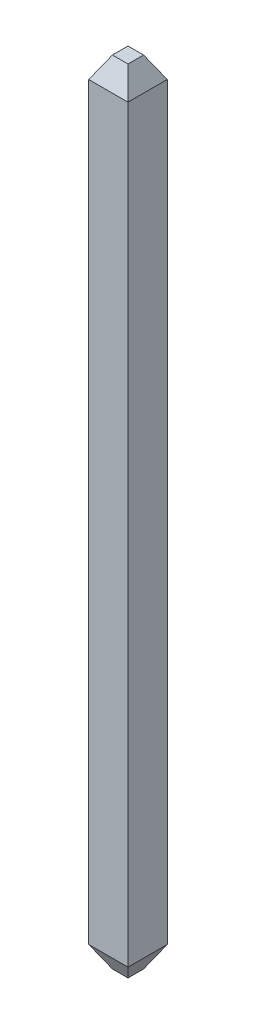
ISO-10303-21;
HEADER;
FILE_DESCRIPTION(('STEP AP214'),'2;1');
FILE_NAME('part.step','',(''),(''),'','','');
FILE_SCHEMA(('AUTOMOTIVE_DESIGN { 1 0 10303 214 1 1 1 1 }'));
ENDSEC;
DATA;
#1=APPLICATION_CONTEXT('core data for automotive mechanical design processes');
#2=APPLICATION_PROTOCOL_DEFINITION('international standard','automotive_design',2000,#1);
#3=PRODUCT_CONTEXT('',#1,'mechanical');
#4=PRODUCT('Part','Part','',(#3));
#5=PRODUCT_RELATED_PRODUCT_CATEGORY('part','',(#4));
#6=PRODUCT_DEFINITION_FORMATION('','',#4);
#7=PRODUCT_DEFINITION_CONTEXT('part definition',#1,'design');
#8=PRODUCT_DEFINITION('design','',#6,#7);
#9=PRODUCT_DEFINITION_SHAPE('','',#8);
#10=(LENGTH_UNIT() NAMED_UNIT(*) SI_UNIT(.MILLI.,.METRE.));
#11=(NAMED_UNIT(*) PLANE_ANGLE_UNIT() SI_UNIT($,.RADIAN.));
#12=(NAMED_UNIT(*) SI_UNIT($,.STERADIAN.) SOLID_ANGLE_UNIT());
#13=UNCERTAINTY_MEASURE_WITH_UNIT(LENGTH_MEASURE(1.E-05),#10,'distance_accuracy_value','');
#14=(GEOMETRIC_REPRESENTATION_CONTEXT(3) GLOBAL_UNCERTAINTY_ASSIGNED_CONTEXT((#13)) GLOBAL_UNIT_ASSIGNED_CONTEXT((#10,
#11,#12)) REPRESENTATION_CONTEXT('',''));
#15=CARTESIAN_POINT('',(0.,0.,0.));
#16=DIRECTION('',(0.,0.,1.));
#17=DIRECTION('',(1.,0.,0.));
#18=AXIS2_PLACEMENT_3D('',#15,#16,#17);
#19=CARTESIAN_POINT('',(0.497289871213,-21.22226807941,-2.830960592368));
#20=DIRECTION('',(0.,0.488489958076213,0.87256951634738));
#21=DIRECTION('',(0.,-0.87256951634738,0.488489958076213));
#22=AXIS2_PLACEMENT_3D('',#19,#20,#21);
#23=PLANE('',#22);
#24=DIRECTION('',(1.,0.,0.));
#25=VECTOR('',#24,1.);
#26=CARTESIAN_POINT('',(0.497289871213,-21.57099360271,-2.63573383614207));
#27=LINE('',#26,#25);
#28=CARTESIAN_POINT('',(0.48728989589798,-21.5709939289416,-2.63573383615462));
#29=VERTEX_POINT('',#28);
#30=CARTESIAN_POINT('',(-0.142710289145667,-21.5709938896675,-2.63573367549548));
#31=VERTEX_POINT('',#30);
#32=EDGE_CURVE('E118',#29,#31,#27,.F.);
#33=ORIENTED_EDGE('',*,*,#32,.F.);
#34=DIRECTION('',(0.438284036988266,-0.784297353956642,0.439072617567844));
#35=VECTOR('',#34,1.);
#36=CARTESIAN_POINT('',(0.29728987121219,-21.2309937745705,-2.826075692787));
#37=LINE('',#36,#35);
#38=CARTESIAN_POINT('',(0.297289871212797,-21.2309937745703,-2.82607569278742));
#39=VERTEX_POINT('',#38);
#40=EDGE_CURVE('E116',#39,#29,#37,.T.);
#41=ORIENTED_EDGE('',*,*,#40,.F.);
#42=DIRECTION('',(-1.,0.,0.));
#43=VECTOR('',#42,1.);
#44=CARTESIAN_POINT('',(0.307289871213,-21.23099377457,-2.826075692787));
#45=LINE('',#44,#43);
#46=CARTESIAN_POINT('',(0.0472898712130213,-21.2309937745702,-2.82607569278742));
#47=VERTEX_POINT('',#46);
#48=EDGE_CURVE('E79',#47,#39,#45,.F.);
#49=ORIENTED_EDGE('',*,*,#48,.F.);
#50=DIRECTION('',(0.438284036988271,0.784297353956651,-0.439072617567822));
#51=VECTOR('',#50,1.);
#52=CARTESIAN_POINT('',(-0.14271012878781,-21.5709936027095,-2.635733836142));
#53=LINE('',#52,#51);
#54=EDGE_CURVE('E110',#31,#47,#53,.T.);
#55=ORIENTED_EDGE('',*,*,#54,.F.);
#56=EDGE_LOOP('',(#33,#41,#49,#55));
#57=FACE_BOUND('',#56,.T.);
#58=ADVANCED_FACE('F17',(#57),#23,.T.);
#59=CARTESIAN_POINT('',(0.497289871213,-33.93541112064,-2.830708664644));
#60=DIRECTION('',(0.,-0.487152273933216,0.873317045523387));
#61=DIRECTION('',(0.,-0.873317045523387,-0.487152273933216));
#62=AXIS2_PLACEMENT_3D('',#59,#60,#61);
#63=PLANE('',#62);
#64=DIRECTION('',(-0.438586917260296,-0.784839349958941,-0.437799852403055));
#65=VECTOR('',#64,1.);
#66=CARTESIAN_POINT('',(0.487290184384019,-33.5866775616409,-2.636177793235));
#67=LINE('',#66,#65);
#68=CARTESIAN_POINT('',(0.487289980136551,-33.5866774630266,-2.63617803823828));
#69=VERTEX_POINT('',#68);
#70=CARTESIAN_POINT('',(0.29728987121302,-33.9266779501895,-2.82583714190599));
#71=VERTEX_POINT('',#70);
#72=EDGE_CURVE('E122',#69,#71,#67,.T.);
#73=ORIENTED_EDGE('',*,*,#72,.F.);
#74=DIRECTION('',(1.,0.,0.));
#75=VECTOR('',#74,1.);
#76=CARTESIAN_POINT('',(0.497289871213,-33.5866774970136,-2.63617715378033));
#77=LINE('',#76,#75);
#78=CARTESIAN_POINT('',(-0.142710305819021,-33.5866774872793,-2.63617803998363));
#79=VERTEX_POINT('',#78);
#80=EDGE_CURVE('E89',#79,#69,#77,.T.);
#81=ORIENTED_EDGE('',*,*,#80,.F.);
#82=DIRECTION('',(-0.438586917260197,0.784839349958759,0.43779985240348));
#83=VECTOR('',#82,1.);
#84=CARTESIAN_POINT('',(0.0472898712136261,-33.9266779501897,-2.825837141905));
#85=LINE('',#84,#83);
#86=CARTESIAN_POINT('',(0.0472898712132013,-33.9266779501894,-2.82583714190599));
#87=VERTEX_POINT('',#86);
#88=EDGE_CURVE('E84',#87,#79,#85,.T.);
#89=ORIENTED_EDGE('',*,*,#88,.F.);
#90=DIRECTION('',(1.,0.,0.));
#91=VECTOR('',#90,1.);
#92=CARTESIAN_POINT('',(0.03728987121306,-33.92667795019,-2.825837141905));
#93=LINE('',#92,#91);
#94=EDGE_CURVE('E20',#71,#87,#93,.F.);
#95=ORIENTED_EDGE('',*,*,#94,.F.);
#96=EDGE_LOOP('',(#73,#81,#89,#95));
#97=FACE_BOUND('',#96,.T.);
#98=ADVANCED_FACE('F86',(#97),#63,.T.);
#99=CARTESIAN_POINT('',(0.03728987121306,-33.92667795019,-3.085837141905));
#100=DIRECTION('',(0.,-1.,0.));
#101=DIRECTION('',(1.,0.,0.));
#102=AXIS2_PLACEMENT_3D('',#99,#100,#101);
#103=PLANE('',#102);
#104=DIRECTION('',(0.,0.,1.));
#105=VECTOR('',#104,1.);
#106=CARTESIAN_POINT('',(0.0472898712136262,-33.9266779501897,-3.276178998549));
#107=LINE('',#106,#105);
#108=CARTESIAN_POINT('',(0.0472898712133431,-33.9266779501896,-3.07583714190458));
#109=VERTEX_POINT('',#108);
#110=EDGE_CURVE('E93',#109,#87,#107,.T.);
#111=ORIENTED_EDGE('',*,*,#110,.F.);
#112=DIRECTION('',(1.,0.,0.));
#113=VECTOR('',#112,1.);
#114=CARTESIAN_POINT('',(0.497289871213,-33.9266779501891,-3.07583714190334));
#115=LINE('',#114,#113);
#116=CARTESIAN_POINT('',(0.29728987121304,-33.9266779501898,-3.07583714190458));
#117=VERTEX_POINT('',#116);
#118=EDGE_CURVE('E129',#117,#109,#115,.F.);
#119=ORIENTED_EDGE('',*,*,#118,.F.);
#120=DIRECTION('',(0.,0.,1.));
#121=VECTOR('',#120,1.);
#122=CARTESIAN_POINT('',(0.297289871213079,-33.92667795019,-3.276178998549));
#123=LINE('',#122,#121);
#124=EDGE_CURVE('E98',#71,#117,#123,.F.);
#125=ORIENTED_EDGE('',*,*,#124,.F.);
#126=ORIENTED_EDGE('',*,*,#94,.T.);
#127=EDGE_LOOP('',(#111,#119,#125,#126));
#128=FACE_BOUND('',#127,.T.);
#129=ADVANCED_FACE('F95',(#128),#103,.T.);
#130=CARTESIAN_POINT('',(0.05216808666874,-33.93540738396,-3.276178998549));
#131=DIRECTION('',(-0.872943377132686,-0.487821545567825,0.));
#132=DIRECTION('',(0.487821545567825,-0.872943377132686,0.));
#133=AXIS2_PLACEMENT_3D('',#130,#131,#132);
#134=PLANE('',#133);
#135=DIRECTION('',(-0.43828470044216,0.784297071672233,-0.439072459537929));
#136=VECTOR('',#135,1.);
#137=CARTESIAN_POINT('',(0.04728987121306,-33.9266779501891,-3.07583714190334));
#138=LINE('',#137,#136);
#139=CARTESIAN_POINT('',(-0.142710211258918,-33.5866782459584,-3.26617818908374));
#140=VERTEX_POINT('',#139);
#141=EDGE_CURVE('E102',#109,#140,#138,.T.);
#142=ORIENTED_EDGE('',*,*,#141,.F.);
#143=ORIENTED_EDGE('',*,*,#110,.T.);
#144=ORIENTED_EDGE('',*,*,#88,.T.);
#145=DIRECTION('',(0.,0.,1.));
#146=VECTOR('',#145,1.);
#147=CARTESIAN_POINT('',(-0.142710128787,-33.58667874778,-2.951009103414));
#148=LINE('',#147,#146);
#149=EDGE_CURVE('E131',#140,#79,#148,.T.);
#150=ORIENTED_EDGE('',*,*,#149,.F.);
#151=EDGE_LOOP('',(#142,#143,#144,#150));
#152=FACE_BOUND('',#151,.T.);
#153=ADVANCED_FACE('F100',(#152),#134,.T.);
#154=CARTESIAN_POINT('',(0.307289871213,-21.23099377457,-3.086075692787));
#155=DIRECTION('',(0.,1.,0.));
#156=DIRECTION('',(-1.,0.,0.));
#157=AXIS2_PLACEMENT_3D('',#154,#155,#156);
#158=PLANE('',#157);
#159=ORIENTED_EDGE('',*,*,#48,.T.);
#160=DIRECTION('',(0.,0.,1.));
#161=VECTOR('',#160,1.);
#162=CARTESIAN_POINT('',(0.29728987121219,-21.2309937745705,-3.275733836142));
#163=LINE('',#162,#161);
#164=CARTESIAN_POINT('',(0.297289871212797,-21.2309937745704,-3.07607569278651));
#165=VERTEX_POINT('',#164);
#166=EDGE_CURVE('E113',#165,#39,#163,.T.);
#167=ORIENTED_EDGE('',*,*,#166,.F.);
#168=DIRECTION('',(1.,0.,0.));
#169=VECTOR('',#168,1.);
#170=CARTESIAN_POINT('',(0.497289871213,-21.2309937745711,-3.07607569278503));
#171=LINE('',#170,#169);
#172=CARTESIAN_POINT('',(0.0472898712130212,-21.2309937745703,-3.07607569278651));
#173=VERTEX_POINT('',#172);
#174=EDGE_CURVE('E140',#173,#165,#171,.T.);
#175=ORIENTED_EDGE('',*,*,#174,.F.);
#176=DIRECTION('',(0.,0.,1.));
#177=VECTOR('',#176,1.);
#178=CARTESIAN_POINT('',(0.047289871212935,-21.2309937745699,-3.275733836142));
#179=LINE('',#178,#177);
#180=EDGE_CURVE('E105',#47,#173,#179,.F.);
#181=ORIENTED_EDGE('',*,*,#180,.F.);
#182=EDGE_LOOP('',(#159,#167,#175,#181));
#183=FACE_BOUND('',#182,.T.);
#184=ADVANCED_FACE('F184',(#183),#158,.T.);
#185=CARTESIAN_POINT('',(-0.147588344243,-21.57972303648,-3.275733836142));
#186=DIRECTION('',(-0.872943377132686,0.487821545567825,0.));
#187=DIRECTION('',(-0.487821545567825,-0.872943377132686,0.));
#188=AXIS2_PLACEMENT_3D('',#185,#186,#187);
#189=PLANE('',#188);
#190=DIRECTION('',(0.,0.,1.));
#191=VECTOR('',#190,1.);
#192=CARTESIAN_POINT('',(-0.142710128787008,-21.57099360271,-2.951009103414));
#193=LINE('',#192,#191);
#194=CARTESIAN_POINT('',(-0.142710835596165,-21.5709953440113,-3.26573424510074));
#195=VERTEX_POINT('',#194);
#196=EDGE_CURVE('E137',#31,#195,#193,.F.);
#197=ORIENTED_EDGE('',*,*,#196,.F.);
#198=ORIENTED_EDGE('',*,*,#54,.T.);
#199=ORIENTED_EDGE('',*,*,#180,.T.);
#200=DIRECTION('',(0.43858642909022,0.784840434712895,0.437798396819316));
#201=VECTOR('',#200,1.);
#202=CARTESIAN_POINT('',(-0.142710849418,-21.5709957406264,-3.26573502870961));
#203=LINE('',#202,#201);
#204=EDGE_CURVE('E145',#195,#173,#203,.T.);
#205=ORIENTED_EDGE('',*,*,#204,.F.);
#206=EDGE_LOOP('',(#197,#198,#199,#205));
#207=FACE_BOUND('',#206,.T.);
#208=ADVANCED_FACE('F182',(#207),#189,.T.);
#209=CARTESIAN_POINT('',(0.292411655757,-21.2222643408,-3.275733836142));
#210=DIRECTION('',(0.872943377132686,0.487821545567825,0.));
#211=DIRECTION('',(-0.487821545567825,0.872943377132686,0.));
#212=AXIS2_PLACEMENT_3D('',#209,#210,#211);
#213=PLANE('',#212);
#214=ORIENTED_EDGE('',*,*,#166,.T.);
#215=ORIENTED_EDGE('',*,*,#40,.T.);
#216=DIRECTION('',(0.,0.,1.));
#217=VECTOR('',#216,1.);
#218=CARTESIAN_POINT('',(0.487289871212996,-21.57099621256,-3.276127345931));
#219=LINE('',#218,#217);
#220=CARTESIAN_POINT('',(0.487290141449586,-21.5709947896532,-3.26573371060214));
#221=VERTEX_POINT('',#220);
#222=EDGE_CURVE('E35',#221,#29,#219,.T.);
#223=ORIENTED_EDGE('',*,*,#222,.F.);
#224=DIRECTION('',(0.438586429090131,-0.784840434712933,-0.437798396819337));
#225=VECTOR('',#224,1.);
#226=CARTESIAN_POINT('',(0.297289871213,-21.2309937745711,-3.07607569278503));
#227=LINE('',#226,#225);
#228=EDGE_CURVE('E143',#165,#221,#227,.T.);
#229=ORIENTED_EDGE('',*,*,#228,.F.);
#230=EDGE_LOOP('',(#214,#215,#223,#229));
#231=FACE_BOUND('',#230,.T.);
#232=ADVANCED_FACE('F185',(#231),#213,.T.);
#233=CARTESIAN_POINT('',(0.497289871213,-21.45033675752,-2.635729384518));
#234=DIRECTION('',(0.,-3.68949151673341E-05,0.999999999319383));
#235=DIRECTION('',(0.,-0.999999999319383,-3.68949151673341E-05));
#236=AXIS2_PLACEMENT_3D('',#233,#234,#235);
#237=PLANE('',#236);
#238=DIRECTION('',(0.,0.999999999317418,3.69481335064018E-05));
#239=VECTOR('',#238,1.);
#240=CARTESIAN_POINT('',(-0.142710128787,-33.58667749699,-2.636177793235));
#241=LINE('',#240,#239);
#242=EDGE_CURVE('E134',#79,#31,#241,.T.);
#243=ORIENTED_EDGE('',*,*,#242,.F.);
#244=ORIENTED_EDGE('',*,*,#80,.T.);
#245=DIRECTION('',(0.,-0.999999999317418,-3.69481335064018E-05));
#246=VECTOR('',#245,1.);
#247=CARTESIAN_POINT('',(0.487289871212996,-21.57099360271,-2.635733836142));
#248=LINE('',#247,#246);
#249=EDGE_CURVE('E149',#29,#69,#248,.T.);
#250=ORIENTED_EDGE('',*,*,#249,.F.);
#251=ORIENTED_EDGE('',*,*,#32,.T.);
#252=EDGE_LOOP('',(#243,#244,#250,#251));
#253=FACE_BOUND('',#252,.T.);
#254=ADVANCED_FACE('F187',(#253),#237,.T.);
#255=CARTESIAN_POINT('',(0.492168086669,-33.57794868828,-3.276178998549));
#256=DIRECTION('',(0.872943377132686,-0.487821545567825,0.));
#257=DIRECTION('',(0.487821545567825,0.872943377132686,0.));
#258=AXIS2_PLACEMENT_3D('',#255,#256,#257);
#259=PLANE('',#258);
#260=ORIENTED_EDGE('',*,*,#124,.T.);
#261=DIRECTION('',(-0.438284700442048,-0.78429707167228,0.439072459537956));
#262=VECTOR('',#261,1.);
#263=CARTESIAN_POINT('',(0.487289673578,-33.5866791127601,-3.26617844392001));
#264=LINE('',#263,#262);
#265=CARTESIAN_POINT('',(0.487289755137329,-33.5866786503075,-3.26617787518449));
#266=VERTEX_POINT('',#265);
#267=EDGE_CURVE('E126',#266,#117,#264,.T.);
#268=ORIENTED_EDGE('',*,*,#267,.F.);
#269=DIRECTION('',(0.,0.,1.));
#270=VECTOR('',#269,1.);
#271=CARTESIAN_POINT('',(0.487289871213004,-33.58667749699,-3.276127345931));
#272=LINE('',#271,#270);
#273=EDGE_CURVE('E152',#69,#266,#272,.F.);
#274=ORIENTED_EDGE('',*,*,#273,.F.);
#275=ORIENTED_EDGE('',*,*,#72,.T.);
#276=EDGE_LOOP('',(#260,#268,#274,#275));
#277=FACE_BOUND('',#276,.T.);
#278=ADVANCED_FACE('F174',(#277),#259,.T.);
#279=CARTESIAN_POINT('',(0.497289871213,-33.93540364535,-3.070952242324));
#280=DIRECTION('',(0.,-0.488489958076213,-0.87256951634738));
#281=DIRECTION('',(0.,0.87256951634738,-0.488489958076213));
#282=AXIS2_PLACEMENT_3D('',#279,#280,#281);
#283=PLANE('',#282);
#284=ORIENTED_EDGE('',*,*,#267,.T.);
#285=ORIENTED_EDGE('',*,*,#118,.T.);
#286=ORIENTED_EDGE('',*,*,#141,.T.);
#287=DIRECTION('',(1.,0.,0.));
#288=VECTOR('',#287,1.);
#289=CARTESIAN_POINT('',(0.497289871213,-33.5866787478035,-3.26617715382711));
#290=LINE('',#289,#288);
#291=EDGE_CURVE('E155',#266,#140,#290,.F.);
#292=ORIENTED_EDGE('',*,*,#291,.F.);
#293=EDGE_LOOP('',(#284,#285,#286,#292));
#294=FACE_BOUND('',#293,.T.);
#295=ADVANCED_FACE('F177',(#294),#283,.T.);
#296=CARTESIAN_POINT('',(-0.142710128787,-33.75733847732,-2.951009103414));
#297=DIRECTION('',(-1.,0.,0.));
#298=DIRECTION('',(0.,-1.,0.));
#299=AXIS2_PLACEMENT_3D('',#296,#297,#298);
#300=PLANE('',#299);
#301=ORIENTED_EDGE('',*,*,#196,.T.);
#302=DIRECTION('',(0.,0.999999999319383,3.68949151676141E-05));
#303=VECTOR('',#302,1.);
#304=CARTESIAN_POINT('',(-0.142709931152,-33.75734199129,-3.266183450433));
#305=LINE('',#304,#303);
#306=EDGE_CURVE('E158',#140,#195,#305,.T.);
#307=ORIENTED_EDGE('',*,*,#306,.F.);
#308=ORIENTED_EDGE('',*,*,#149,.T.);
#309=ORIENTED_EDGE('',*,*,#242,.T.);
#310=EDGE_LOOP('',(#301,#307,#308,#309));
#311=FACE_BOUND('',#310,.T.);
#312=ADVANCED_FACE('F179',(#311),#300,.T.);
#313=CARTESIAN_POINT('',(0.497289871213,-21.22226060412,-3.071204170048));
#314=DIRECTION('',(0.,0.487152273933216,-0.873317045523387));
#315=DIRECTION('',(0.,0.873317045523387,0.487152273933216));
#316=AXIS2_PLACEMENT_3D('',#313,#314,#315);
#317=PLANE('',#316);
#318=DIRECTION('',(1.,0.,0.));
#319=VECTOR('',#318,1.);
#320=CARTESIAN_POINT('',(0.497289871213,-21.5709962125728,-3.26573383623899));
#321=LINE('',#320,#319);
#322=EDGE_CURVE('E26',#195,#221,#321,.T.);
#323=ORIENTED_EDGE('',*,*,#322,.F.);
#324=ORIENTED_EDGE('',*,*,#204,.T.);
#325=ORIENTED_EDGE('',*,*,#174,.T.);
#326=ORIENTED_EDGE('',*,*,#228,.T.);
#327=EDGE_LOOP('',(#323,#324,#325,#326));
#328=FACE_BOUND('',#327,.T.);
#329=ADVANCED_FACE('F168',(#328),#317,.T.);
#330=CARTESIAN_POINT('',(0.487289871213,-27.60384299983,-3.276127345931));
#331=DIRECTION('',(1.,0.,0.));
#332=DIRECTION('',(0.,1.,0.));
#333=AXIS2_PLACEMENT_3D('',#330,#331,#332);
#334=PLANE('',#333);
#335=ORIENTED_EDGE('',*,*,#249,.T.);
#336=ORIENTED_EDGE('',*,*,#273,.T.);
#337=DIRECTION('',(0.,0.999999999319383,3.68949151676141E-05));
#338=VECTOR('',#337,1.);
#339=CARTESIAN_POINT('',(0.487290591844,-33.75734199129,-3.266183450433));
#340=LINE('',#339,#338);
#341=EDGE_CURVE('E11',#221,#266,#340,.F.);
#342=ORIENTED_EDGE('',*,*,#341,.F.);
#343=ORIENTED_EDGE('',*,*,#222,.T.);
#344=EDGE_LOOP('',(#335,#336,#342,#343));
#345=FACE_BOUND('',#344,.T.);
#346=ADVANCED_FACE('F170',(#345),#334,.T.);
#347=CARTESIAN_POINT('',(0.497289871213,-33.75734199129,-3.266183450433));
#348=DIRECTION('',(0.,3.68949151676141E-05,-0.999999999319383));
#349=DIRECTION('',(0.,0.999999999319383,3.68949151676141E-05));
#350=AXIS2_PLACEMENT_3D('',#347,#348,#349);
#351=PLANE('',#350);
#352=ORIENTED_EDGE('',*,*,#322,.T.);
#353=ORIENTED_EDGE('',*,*,#341,.T.);
#354=ORIENTED_EDGE('',*,*,#291,.T.);
#355=ORIENTED_EDGE('',*,*,#306,.T.);
#356=EDGE_LOOP('',(#352,#353,#354,#355));
#357=FACE_BOUND('',#356,.T.);
#358=ADVANCED_FACE('F164',(#357),#351,.T.);
#359=CLOSED_SHELL('',(#58,#98,#129,#153,#184,#208,#232,#254,#278,#295,#312,#329,#346,#358));
#360=MANIFOLD_SOLID_BREP('B1',#359);
#361=ADVANCED_BREP_SHAPE_REPRESENTATION('',(#18,#360),#14);
#362=SHAPE_DEFINITION_REPRESENTATION(#9,#361);
ENDSEC;
END-ISO-10303-21;
